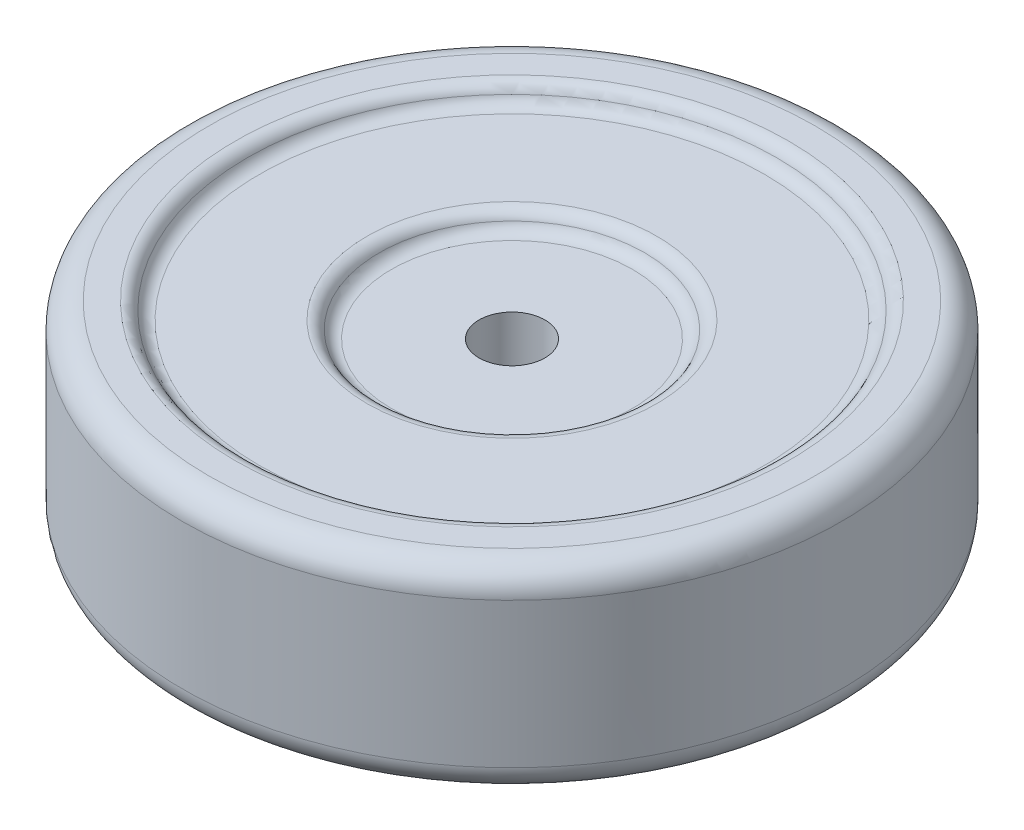
ISO-10303-21;
HEADER;
FILE_DESCRIPTION(('STEP AP214'),'2;1');
FILE_NAME('part.step','',(''),(''),'','','');
FILE_SCHEMA(('AUTOMOTIVE_DESIGN { 1 0 10303 214 1 1 1 1 }'));
ENDSEC;
DATA;
#1=APPLICATION_CONTEXT('core data for automotive mechanical design processes');
#2=APPLICATION_PROTOCOL_DEFINITION('international standard','automotive_design',2000,#1);
#3=PRODUCT_CONTEXT('',#1,'mechanical');
#4=PRODUCT('Part','Part','',(#3));
#5=PRODUCT_RELATED_PRODUCT_CATEGORY('part','',(#4));
#6=PRODUCT_DEFINITION_FORMATION('','',#4);
#7=PRODUCT_DEFINITION_CONTEXT('part definition',#1,'design');
#8=PRODUCT_DEFINITION('design','',#6,#7);
#9=PRODUCT_DEFINITION_SHAPE('','',#8);
#10=(LENGTH_UNIT() NAMED_UNIT(*) SI_UNIT(.MILLI.,.METRE.));
#11=(NAMED_UNIT(*) PLANE_ANGLE_UNIT() SI_UNIT($,.RADIAN.));
#12=(NAMED_UNIT(*) SI_UNIT($,.STERADIAN.) SOLID_ANGLE_UNIT());
#13=UNCERTAINTY_MEASURE_WITH_UNIT(LENGTH_MEASURE(1.E-05),#10,'distance_accuracy_value','');
#14=(GEOMETRIC_REPRESENTATION_CONTEXT(3) GLOBAL_UNCERTAINTY_ASSIGNED_CONTEXT((#13)) GLOBAL_UNIT_ASSIGNED_CONTEXT((#10,
#11,#12)) REPRESENTATION_CONTEXT('',''));
#15=CARTESIAN_POINT('',(0.,0.,0.));
#16=DIRECTION('',(0.,0.,1.));
#17=DIRECTION('',(1.,0.,0.));
#18=AXIS2_PLACEMENT_3D('',#15,#16,#17);
#19=CARTESIAN_POINT('',(0.,38.1,0.));
#20=DIRECTION('',(0.,-1.,0.));
#21=DIRECTION('',(0.,0.,-1.));
#22=AXIS2_PLACEMENT_3D('',#19,#20,#21);
#23=CYLINDRICAL_SURFACE('',#22,127.);
#24=CARTESIAN_POINT('',(0.,-27.94,0.));
#25=DIRECTION('',(0.,-1.,0.));
#26=DIRECTION('',(0.,0.,-1.));
#27=AXIS2_PLACEMENT_3D('',#24,#25,#26);
#28=CIRCLE('',#27,127.);
#29=CARTESIAN_POINT('',(0.,-27.94,-127.));
#30=VERTEX_POINT('',#29);
#31=EDGE_CURVE('E71',#30,#30,#28,.F.);
#32=ORIENTED_EDGE('',*,*,#31,.T.);
#33=EDGE_LOOP('',(#32));
#34=FACE_BOUND('',#33,.T.);
#35=CARTESIAN_POINT('',(0.,27.94,0.));
#36=DIRECTION('',(0.,1.,0.));
#37=DIRECTION('',(0.,0.,1.));
#38=AXIS2_PLACEMENT_3D('',#35,#36,#37);
#39=CIRCLE('',#38,127.);
#40=CARTESIAN_POINT('',(0.,27.94,127.));
#41=VERTEX_POINT('',#40);
#42=EDGE_CURVE('E92',#41,#41,#39,.F.);
#43=ORIENTED_EDGE('',*,*,#42,.T.);
#44=EDGE_LOOP('',(#43));
#45=FACE_BOUND('',#44,.T.);
#46=ADVANCED_FACE('F42',(#34,#45),#23,.T.);
#47=CARTESIAN_POINT('',(0.,38.1,0.));
#48=DIRECTION('',(0.,1.,0.));
#49=DIRECTION('',(0.,0.,1.));
#50=AXIS2_PLACEMENT_3D('',#47,#48,#49);
#51=PLANE('',#50);
#52=CARTESIAN_POINT('',(0.,38.1,0.));
#53=DIRECTION('',(0.,1.,0.));
#54=DIRECTION('',(0.,0.,1.));
#55=AXIS2_PLACEMENT_3D('',#52,#53,#54);
#56=CIRCLE('',#55,106.68);
#57=CARTESIAN_POINT('',(0.,38.1,106.68));
#58=VERTEX_POINT('',#57);
#59=EDGE_CURVE('E89',#58,#58,#56,.F.);
#60=ORIENTED_EDGE('',*,*,#59,.T.);
#61=EDGE_LOOP('',(#60));
#62=FACE_BOUND('',#61,.T.);
#63=CARTESIAN_POINT('',(0.,38.1,0.));
#64=DIRECTION('',(0.,1.,0.));
#65=DIRECTION('',(0.,0.,1.));
#66=AXIS2_PLACEMENT_3D('',#63,#64,#65);
#67=CIRCLE('',#66,116.84);
#68=CARTESIAN_POINT('',(0.,38.1,116.84));
#69=VERTEX_POINT('',#68);
#70=EDGE_CURVE('E95',#69,#69,#67,.T.);
#71=ORIENTED_EDGE('',*,*,#70,.T.);
#72=EDGE_LOOP('',(#71));
#73=FACE_BOUND('',#72,.T.);
#74=ADVANCED_FACE('F125',(#62,#73),#51,.T.);
#75=CARTESIAN_POINT('',(0.,31.75,0.));
#76=DIRECTION('',(0.,1.,0.));
#77=DIRECTION('',(0.,0.,1.));
#78=AXIS2_PLACEMENT_3D('',#75,#76,#77);
#79=PLANE('',#78);
#80=CARTESIAN_POINT('',(0.,31.75,0.));
#81=DIRECTION('',(0.,1.,0.));
#82=DIRECTION('',(0.,0.,1.));
#83=AXIS2_PLACEMENT_3D('',#80,#81,#82);
#84=CIRCLE('',#83,55.88);
#85=CARTESIAN_POINT('',(0.,31.75,55.88));
#86=VERTEX_POINT('',#85);
#87=EDGE_CURVE('E80',#86,#86,#84,.F.);
#88=ORIENTED_EDGE('',*,*,#87,.T.);
#89=EDGE_LOOP('',(#88));
#90=FACE_BOUND('',#89,.T.);
#91=CARTESIAN_POINT('',(0.,31.75,0.));
#92=DIRECTION('',(0.,1.,0.));
#93=DIRECTION('',(0.,0.,1.));
#94=AXIS2_PLACEMENT_3D('',#91,#92,#93);
#95=CIRCLE('',#94,97.2614279213885);
#96=CARTESIAN_POINT('',(0.,31.75,97.2614279213885));
#97=VERTEX_POINT('',#96);
#98=EDGE_CURVE('E86',#97,#97,#95,.T.);
#99=ORIENTED_EDGE('',*,*,#98,.T.);
#100=EDGE_LOOP('',(#99));
#101=FACE_BOUND('',#100,.T.);
#102=ADVANCED_FACE('F120',(#90,#101),#79,.T.);
#103=CARTESIAN_POINT('',(0.,25.4,0.));
#104=DIRECTION('',(0.,1.,0.));
#105=DIRECTION('',(0.,0.,1.));
#106=AXIS2_PLACEMENT_3D('',#103,#104,#105);
#107=PLANE('',#106);
#108=CARTESIAN_POINT('',(0.,25.4,0.));
#109=DIRECTION('',(0.,1.,0.));
#110=DIRECTION('',(0.,0.,1.));
#111=AXIS2_PLACEMENT_3D('',#108,#109,#110);
#112=CIRCLE('',#111,46.4614279213885);
#113=CARTESIAN_POINT('',(0.,25.4,46.4614279213885));
#114=VERTEX_POINT('',#113);
#115=EDGE_CURVE('E77',#114,#114,#112,.T.);
#116=ORIENTED_EDGE('',*,*,#115,.T.);
#117=EDGE_LOOP('',(#116));
#118=FACE_BOUND('',#117,.T.);
#119=CARTESIAN_POINT('',(0.,25.4,0.));
#120=DIRECTION('',(0.,1.,0.));
#121=DIRECTION('',(0.,0.,1.));
#122=AXIS2_PLACEMENT_3D('',#119,#120,#121);
#123=CIRCLE('',#122,12.7);
#124=CARTESIAN_POINT('',(0.,25.4,12.7));
#125=VERTEX_POINT('',#124);
#126=EDGE_CURVE('E98',#125,#125,#123,.T.);
#127=ORIENTED_EDGE('',*,*,#126,.F.);
#128=EDGE_LOOP('',(#127));
#129=FACE_BOUND('',#128,.T.);
#130=ADVANCED_FACE('F110',(#118,#129),#107,.T.);
#131=CARTESIAN_POINT('',(0.,-52.578,0.));
#132=DIRECTION('',(0.,1.,0.));
#133=DIRECTION('',(0.,0.,1.));
#134=AXIS2_PLACEMENT_3D('',#131,#132,#133);
#135=CYLINDRICAL_SURFACE('',#134,12.7);
#136=ORIENTED_EDGE('',*,*,#126,.T.);
#137=EDGE_LOOP('',(#136));
#138=FACE_BOUND('',#137,.T.);
#139=CARTESIAN_POINT('',(0.,-25.4,0.));
#140=DIRECTION('',(0.,1.,0.));
#141=DIRECTION('',(0.,0.,1.));
#142=AXIS2_PLACEMENT_3D('',#139,#140,#141);
#143=CIRCLE('',#142,12.7);
#144=CARTESIAN_POINT('',(0.,-25.4,12.7));
#145=VERTEX_POINT('',#144);
#146=EDGE_CURVE('E101',#145,#145,#143,.T.);
#147=ORIENTED_EDGE('',*,*,#146,.F.);
#148=EDGE_LOOP('',(#147));
#149=FACE_BOUND('',#148,.T.);
#150=ADVANCED_FACE('F107',(#138,#149),#135,.F.);
#151=CARTESIAN_POINT('',(0.,27.94,0.));
#152=DIRECTION('',(0.,1.,0.));
#153=DIRECTION('',(0.,0.,1.));
#154=AXIS2_PLACEMENT_3D('',#151,#152,#153);
#155=TOROIDAL_SURFACE('',#154,116.84,10.16);
#156=ORIENTED_EDGE('',*,*,#42,.F.);
#157=EDGE_LOOP('',(#156));
#158=FACE_BOUND('',#157,.T.);
#159=ORIENTED_EDGE('',*,*,#70,.F.);
#160=EDGE_LOOP('',(#159));
#161=FACE_BOUND('',#160,.T.);
#162=ADVANCED_FACE('F109',(#158,#161),#155,.T.);
#163=CARTESIAN_POINT('',(0.,33.02,0.));
#164=DIRECTION('',(0.,1.,0.));
#165=DIRECTION('',(0.,0.,1.));
#166=AXIS2_PLACEMENT_3D('',#163,#164,#165);
#167=TOROIDAL_SURFACE('',#166,106.68,5.08);
#168=CARTESIAN_POINT('',(0.,34.925,0.));
#169=DIRECTION('',(0.,-1.,0.));
#170=DIRECTION('',(0.,0.,-1.));
#171=AXIS2_PLACEMENT_3D('',#168,#169,#170);
#172=CIRCLE('',#171,101.970713960694);
#173=CARTESIAN_POINT('',(0.,34.925,-101.970713960694));
#174=VERTEX_POINT('',#173);
#175=EDGE_CURVE('E83',#174,#174,#172,.T.);
#176=ORIENTED_EDGE('',*,*,#175,.T.);
#177=EDGE_LOOP('',(#176));
#178=FACE_BOUND('',#177,.T.);
#179=ORIENTED_EDGE('',*,*,#59,.F.);
#180=EDGE_LOOP('',(#179));
#181=FACE_BOUND('',#180,.T.);
#182=ADVANCED_FACE('F117',(#178,#181),#167,.T.);
#183=CARTESIAN_POINT('',(0.,36.83,0.));
#184=DIRECTION('',(0.,-1.,0.));
#185=DIRECTION('',(0.,0.,-1.));
#186=AXIS2_PLACEMENT_3D('',#183,#184,#185);
#187=TOROIDAL_SURFACE('',#186,97.2614279213885,5.08);
#188=ORIENTED_EDGE('',*,*,#175,.F.);
#189=EDGE_LOOP('',(#188));
#190=FACE_BOUND('',#189,.T.);
#191=ORIENTED_EDGE('',*,*,#98,.F.);
#192=EDGE_LOOP('',(#191));
#193=FACE_BOUND('',#192,.T.);
#194=ADVANCED_FACE('F138',(#190,#193),#187,.F.);
#195=CARTESIAN_POINT('',(0.,26.67,0.));
#196=DIRECTION('',(0.,1.,0.));
#197=DIRECTION('',(0.,0.,1.));
#198=AXIS2_PLACEMENT_3D('',#195,#196,#197);
#199=TOROIDAL_SURFACE('',#198,55.88,5.08);
#200=CARTESIAN_POINT('',(0.,28.5749999999999,0.));
#201=DIRECTION('',(0.,-1.,0.));
#202=DIRECTION('',(0.,0.,-1.));
#203=AXIS2_PLACEMENT_3D('',#200,#201,#202);
#204=CIRCLE('',#203,51.1707139606944);
#205=CARTESIAN_POINT('',(0.,28.5749999999999,-51.1707139606944));
#206=VERTEX_POINT('',#205);
#207=EDGE_CURVE('E74',#206,#206,#204,.T.);
#208=ORIENTED_EDGE('',*,*,#207,.T.);
#209=EDGE_LOOP('',(#208));
#210=FACE_BOUND('',#209,.T.);
#211=ORIENTED_EDGE('',*,*,#87,.F.);
#212=EDGE_LOOP('',(#211));
#213=FACE_BOUND('',#212,.T.);
#214=ADVANCED_FACE('F142',(#210,#213),#199,.T.);
#215=CARTESIAN_POINT('',(0.,30.48,0.));
#216=DIRECTION('',(0.,-1.,0.));
#217=DIRECTION('',(0.,0.,-1.));
#218=AXIS2_PLACEMENT_3D('',#215,#216,#217);
#219=TOROIDAL_SURFACE('',#218,46.4614279213885,5.08);
#220=ORIENTED_EDGE('',*,*,#207,.F.);
#221=EDGE_LOOP('',(#220));
#222=FACE_BOUND('',#221,.T.);
#223=ORIENTED_EDGE('',*,*,#115,.F.);
#224=EDGE_LOOP('',(#223));
#225=FACE_BOUND('',#224,.T.);
#226=ADVANCED_FACE('F146',(#222,#225),#219,.F.);
#227=CARTESIAN_POINT('',(0.,-38.1,0.));
#228=DIRECTION('',(0.,-1.,0.));
#229=DIRECTION('',(0.,0.,1.));
#230=AXIS2_PLACEMENT_3D('',#227,#228,#229);
#231=PLANE('',#230);
#232=CARTESIAN_POINT('',(0.,-38.1,0.));
#233=DIRECTION('',(0.,-1.,0.));
#234=DIRECTION('',(0.,0.,-1.));
#235=AXIS2_PLACEMENT_3D('',#232,#233,#234);
#236=CIRCLE('',#235,106.68);
#237=CARTESIAN_POINT('',(0.,-38.1,-106.68));
#238=VERTEX_POINT('',#237);
#239=EDGE_CURVE('E65',#238,#238,#236,.F.);
#240=ORIENTED_EDGE('',*,*,#239,.T.);
#241=EDGE_LOOP('',(#240));
#242=FACE_BOUND('',#241,.T.);
#243=CARTESIAN_POINT('',(0.,-38.1,0.));
#244=DIRECTION('',(0.,-1.,0.));
#245=DIRECTION('',(0.,0.,-1.));
#246=AXIS2_PLACEMENT_3D('',#243,#244,#245);
#247=CIRCLE('',#246,116.84);
#248=CARTESIAN_POINT('',(0.,-38.1,-116.84));
#249=VERTEX_POINT('',#248);
#250=EDGE_CURVE('E68',#249,#249,#247,.T.);
#251=ORIENTED_EDGE('',*,*,#250,.T.);
#252=EDGE_LOOP('',(#251));
#253=FACE_BOUND('',#252,.T.);
#254=ADVANCED_FACE('F150',(#242,#253),#231,.T.);
#255=CARTESIAN_POINT('',(0.,-31.75,0.));
#256=DIRECTION('',(0.,-1.,0.));
#257=DIRECTION('',(0.,0.,1.));
#258=AXIS2_PLACEMENT_3D('',#255,#256,#257);
#259=PLANE('',#258);
#260=CARTESIAN_POINT('',(0.,-31.75,0.));
#261=DIRECTION('',(0.,-1.,0.));
#262=DIRECTION('',(0.,0.,-1.));
#263=AXIS2_PLACEMENT_3D('',#260,#261,#262);
#264=CIRCLE('',#263,55.88);
#265=CARTESIAN_POINT('',(0.,-31.75,-55.88));
#266=VERTEX_POINT('',#265);
#267=EDGE_CURVE('E53',#266,#266,#264,.F.);
#268=ORIENTED_EDGE('',*,*,#267,.T.);
#269=EDGE_LOOP('',(#268));
#270=FACE_BOUND('',#269,.T.);
#271=CARTESIAN_POINT('',(0.,-31.75,0.));
#272=DIRECTION('',(0.,-1.,0.));
#273=DIRECTION('',(0.,0.,-1.));
#274=AXIS2_PLACEMENT_3D('',#271,#272,#273);
#275=CIRCLE('',#274,97.2614279213885);
#276=CARTESIAN_POINT('',(0.,-31.75,-97.2614279213885));
#277=VERTEX_POINT('',#276);
#278=EDGE_CURVE('E57',#277,#277,#275,.T.);
#279=ORIENTED_EDGE('',*,*,#278,.T.);
#280=EDGE_LOOP('',(#279));
#281=FACE_BOUND('',#280,.T.);
#282=ADVANCED_FACE('F172',(#270,#281),#259,.T.);
#283=CARTESIAN_POINT('',(0.,-25.4,0.));
#284=DIRECTION('',(0.,-1.,0.));
#285=DIRECTION('',(0.,0.,1.));
#286=AXIS2_PLACEMENT_3D('',#283,#284,#285);
#287=PLANE('',#286);
#288=CARTESIAN_POINT('',(0.,-25.4,0.));
#289=DIRECTION('',(0.,-1.,0.));
#290=DIRECTION('',(0.,0.,-1.));
#291=AXIS2_PLACEMENT_3D('',#288,#289,#290);
#292=CIRCLE('',#291,46.4614279213885);
#293=CARTESIAN_POINT('',(0.,-25.4,-46.4614279213885));
#294=VERTEX_POINT('',#293);
#295=EDGE_CURVE('E10',#294,#294,#292,.T.);
#296=ORIENTED_EDGE('',*,*,#295,.T.);
#297=EDGE_LOOP('',(#296));
#298=FACE_BOUND('',#297,.T.);
#299=ORIENTED_EDGE('',*,*,#146,.T.);
#300=EDGE_LOOP('',(#299));
#301=FACE_BOUND('',#300,.T.);
#302=ADVANCED_FACE('F105',(#298,#301),#287,.T.);
#303=CARTESIAN_POINT('',(0.,-27.94,0.));
#304=DIRECTION('',(0.,-1.,0.));
#305=DIRECTION('',(0.,0.,-1.));
#306=AXIS2_PLACEMENT_3D('',#303,#304,#305);
#307=TOROIDAL_SURFACE('',#306,116.84,10.16);
#308=ORIENTED_EDGE('',*,*,#250,.F.);
#309=EDGE_LOOP('',(#308));
#310=FACE_BOUND('',#309,.T.);
#311=ORIENTED_EDGE('',*,*,#31,.F.);
#312=EDGE_LOOP('',(#311));
#313=FACE_BOUND('',#312,.T.);
#314=ADVANCED_FACE('F152',(#310,#313),#307,.T.);
#315=CARTESIAN_POINT('',(0.,-33.02,0.));
#316=DIRECTION('',(0.,-1.,0.));
#317=DIRECTION('',(0.,0.,-1.));
#318=AXIS2_PLACEMENT_3D('',#315,#316,#317);
#319=TOROIDAL_SURFACE('',#318,106.68,5.08);
#320=CARTESIAN_POINT('',(0.,-34.925,0.));
#321=DIRECTION('',(0.,1.,0.));
#322=DIRECTION('',(0.,0.,1.));
#323=AXIS2_PLACEMENT_3D('',#320,#321,#322);
#324=CIRCLE('',#323,101.970713960694);
#325=CARTESIAN_POINT('',(0.,-34.925,101.970713960694));
#326=VERTEX_POINT('',#325);
#327=EDGE_CURVE('E62',#326,#326,#324,.T.);
#328=ORIENTED_EDGE('',*,*,#327,.T.);
#329=EDGE_LOOP('',(#328));
#330=FACE_BOUND('',#329,.T.);
#331=ORIENTED_EDGE('',*,*,#239,.F.);
#332=EDGE_LOOP('',(#331));
#333=FACE_BOUND('',#332,.T.);
#334=ADVANCED_FACE('F155',(#330,#333),#319,.T.);
#335=CARTESIAN_POINT('',(0.,-36.83,0.));
#336=DIRECTION('',(0.,1.,0.));
#337=DIRECTION('',(0.,0.,1.));
#338=AXIS2_PLACEMENT_3D('',#335,#336,#337);
#339=TOROIDAL_SURFACE('',#338,97.2614279213885,5.08);
#340=ORIENTED_EDGE('',*,*,#278,.F.);
#341=EDGE_LOOP('',(#340));
#342=FACE_BOUND('',#341,.T.);
#343=ORIENTED_EDGE('',*,*,#327,.F.);
#344=EDGE_LOOP('',(#343));
#345=FACE_BOUND('',#344,.T.);
#346=ADVANCED_FACE('F159',(#342,#345),#339,.F.);
#347=CARTESIAN_POINT('',(0.,-26.67,0.));
#348=DIRECTION('',(0.,-1.,0.));
#349=DIRECTION('',(0.,0.,-1.));
#350=AXIS2_PLACEMENT_3D('',#347,#348,#349);
#351=TOROIDAL_SURFACE('',#350,55.88,5.08);
#352=CARTESIAN_POINT('',(0.,-28.5749999999999,0.));
#353=DIRECTION('',(0.,1.,0.));
#354=DIRECTION('',(0.,0.,1.));
#355=AXIS2_PLACEMENT_3D('',#352,#353,#354);
#356=CIRCLE('',#355,51.1707139606944);
#357=CARTESIAN_POINT('',(0.,-28.5749999999999,51.1707139606944));
#358=VERTEX_POINT('',#357);
#359=EDGE_CURVE('E49',#358,#358,#356,.T.);
#360=ORIENTED_EDGE('',*,*,#359,.T.);
#361=EDGE_LOOP('',(#360));
#362=FACE_BOUND('',#361,.T.);
#363=ORIENTED_EDGE('',*,*,#267,.F.);
#364=EDGE_LOOP('',(#363));
#365=FACE_BOUND('',#364,.T.);
#366=ADVANCED_FACE('F162',(#362,#365),#351,.T.);
#367=CARTESIAN_POINT('',(0.,-30.48,0.));
#368=DIRECTION('',(0.,1.,0.));
#369=DIRECTION('',(0.,0.,1.));
#370=AXIS2_PLACEMENT_3D('',#367,#368,#369);
#371=TOROIDAL_SURFACE('',#370,46.4614279213885,5.08);
#372=ORIENTED_EDGE('',*,*,#295,.F.);
#373=EDGE_LOOP('',(#372));
#374=FACE_BOUND('',#373,.T.);
#375=ORIENTED_EDGE('',*,*,#359,.F.);
#376=EDGE_LOOP('',(#375));
#377=FACE_BOUND('',#376,.T.);
#378=ADVANCED_FACE('F44',(#374,#377),#371,.F.);
#379=CLOSED_SHELL('',(#46,#74,#102,#130,#150,#162,#182,#194,#214,#226,#254,#282,#302,#314,#334,
#346,#366,#378));
#380=MANIFOLD_SOLID_BREP('B2',#379);
#381=ADVANCED_BREP_SHAPE_REPRESENTATION('',(#18,#380),#14);
#382=SHAPE_DEFINITION_REPRESENTATION(#9,#381);
ENDSEC;
END-ISO-10303-21;
